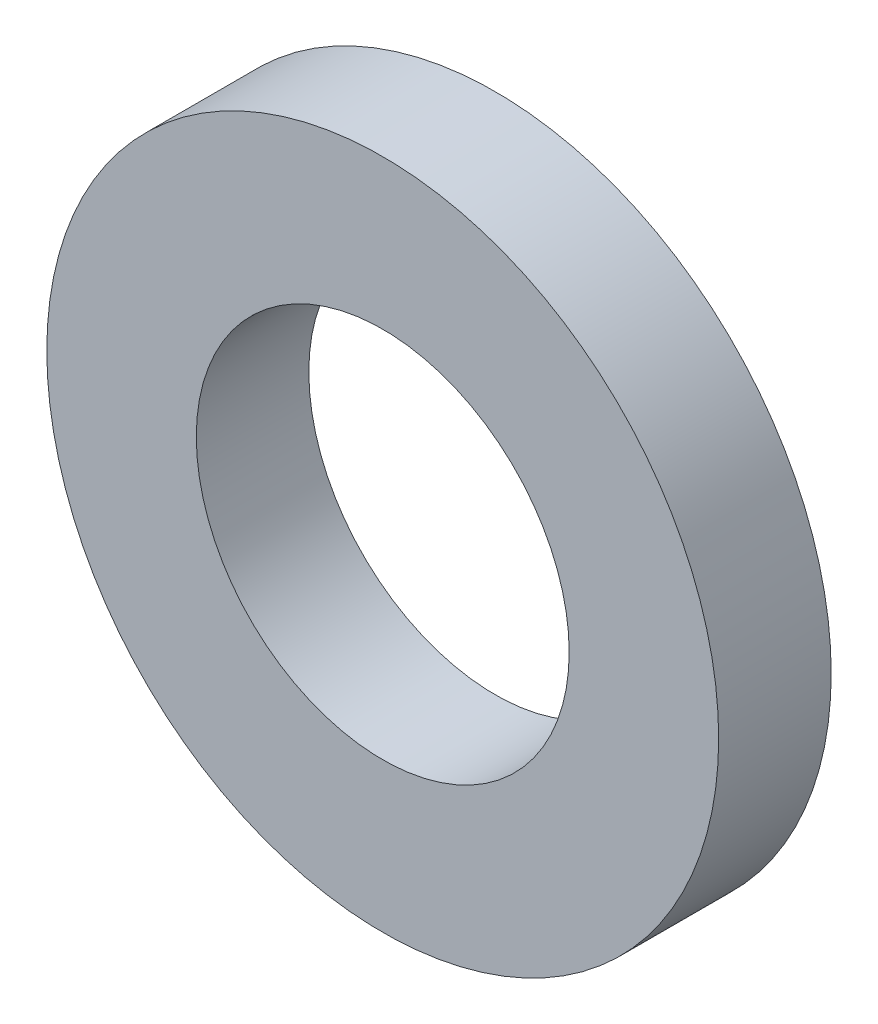
ISO-10303-21;
HEADER;
FILE_DESCRIPTION(('STEP AP214'),'2;1');
FILE_NAME('part.step','',(''),(''),'','','');
FILE_SCHEMA(('AUTOMOTIVE_DESIGN { 1 0 10303 214 1 1 1 1 }'));
ENDSEC;
DATA;
#1=APPLICATION_CONTEXT('core data for automotive mechanical design processes');
#2=APPLICATION_PROTOCOL_DEFINITION('international standard','automotive_design',2000,#1);
#3=PRODUCT_CONTEXT('',#1,'mechanical');
#4=PRODUCT('Part','Part','',(#3));
#5=PRODUCT_RELATED_PRODUCT_CATEGORY('part','',(#4));
#6=PRODUCT_DEFINITION_FORMATION('','',#4);
#7=PRODUCT_DEFINITION_CONTEXT('part definition',#1,'design');
#8=PRODUCT_DEFINITION('design','',#6,#7);
#9=PRODUCT_DEFINITION_SHAPE('','',#8);
#10=(LENGTH_UNIT() NAMED_UNIT(*) SI_UNIT(.MILLI.,.METRE.));
#11=(NAMED_UNIT(*) PLANE_ANGLE_UNIT() SI_UNIT($,.RADIAN.));
#12=(NAMED_UNIT(*) SI_UNIT($,.STERADIAN.) SOLID_ANGLE_UNIT());
#13=UNCERTAINTY_MEASURE_WITH_UNIT(LENGTH_MEASURE(1.E-05),#10,'distance_accuracy_value','');
#14=(GEOMETRIC_REPRESENTATION_CONTEXT(3) GLOBAL_UNCERTAINTY_ASSIGNED_CONTEXT((#13)) GLOBAL_UNIT_ASSIGNED_CONTEXT((#10,
#11,#12)) REPRESENTATION_CONTEXT('',''));
#15=CARTESIAN_POINT('',(0.,0.,0.));
#16=DIRECTION('',(0.,0.,1.));
#17=DIRECTION('',(1.,0.,0.));
#18=AXIS2_PLACEMENT_3D('',#15,#16,#17);
#19=CARTESIAN_POINT('',(0.,0.,0.889));
#20=DIRECTION('',(0.,0.,1.));
#21=DIRECTION('',(1.,0.,0.));
#22=AXIS2_PLACEMENT_3D('',#19,#20,#21);
#23=PLANE('',#22);
#24=CARTESIAN_POINT('',(0.,0.,0.889));
#25=DIRECTION('',(0.,0.,1.));
#26=DIRECTION('',(1.,0.,0.));
#27=AXIS2_PLACEMENT_3D('',#24,#25,#26);
#28=CIRCLE('',#27,2.6543);
#29=CARTESIAN_POINT('',(2.6543,0.,0.889));
#30=VERTEX_POINT('',#29);
#31=EDGE_CURVE('E10',#30,#30,#28,.T.);
#32=ORIENTED_EDGE('',*,*,#31,.T.);
#33=EDGE_LOOP('',(#32));
#34=FACE_BOUND('',#33,.T.);
#35=CARTESIAN_POINT('',(0.,0.,0.889));
#36=DIRECTION('',(0.,0.,1.));
#37=DIRECTION('',(1.,0.,0.));
#38=AXIS2_PLACEMENT_3D('',#35,#36,#37);
#39=CIRCLE('',#38,1.4732);
#40=CARTESIAN_POINT('',(1.4732,0.,0.889));
#41=VERTEX_POINT('',#40);
#42=EDGE_CURVE('E43',#41,#41,#39,.T.);
#43=ORIENTED_EDGE('',*,*,#42,.F.);
#44=EDGE_LOOP('',(#43));
#45=FACE_BOUND('',#44,.T.);
#46=ADVANCED_FACE('F32',(#34,#45),#23,.T.);
#47=CARTESIAN_POINT('',(0.,0.,0.));
#48=DIRECTION('',(0.,0.,1.));
#49=DIRECTION('',(1.,0.,0.));
#50=AXIS2_PLACEMENT_3D('',#47,#48,#49);
#51=PLANE('',#50);
#52=CARTESIAN_POINT('',(0.,0.,0.));
#53=DIRECTION('',(0.,0.,1.));
#54=DIRECTION('',(1.,0.,0.));
#55=AXIS2_PLACEMENT_3D('',#52,#53,#54);
#56=CIRCLE('',#55,2.6543);
#57=CARTESIAN_POINT('',(2.6543,0.,0.));
#58=VERTEX_POINT('',#57);
#59=EDGE_CURVE('E36',#58,#58,#56,.T.);
#60=ORIENTED_EDGE('',*,*,#59,.F.);
#61=EDGE_LOOP('',(#60));
#62=FACE_BOUND('',#61,.T.);
#63=CARTESIAN_POINT('',(0.,0.,0.));
#64=DIRECTION('',(0.,0.,1.));
#65=DIRECTION('',(1.,0.,0.));
#66=AXIS2_PLACEMENT_3D('',#63,#64,#65);
#67=CIRCLE('',#66,1.4732);
#68=CARTESIAN_POINT('',(1.4732,0.,0.));
#69=VERTEX_POINT('',#68);
#70=EDGE_CURVE('E45',#69,#69,#67,.T.);
#71=ORIENTED_EDGE('',*,*,#70,.T.);
#72=EDGE_LOOP('',(#71));
#73=FACE_BOUND('',#72,.T.);
#74=ADVANCED_FACE('F55',(#62,#73),#51,.F.);
#75=CARTESIAN_POINT('',(0.,0.,0.889));
#76=DIRECTION('',(0.,0.,-1.));
#77=DIRECTION('',(-1.,0.,0.));
#78=AXIS2_PLACEMENT_3D('',#75,#76,#77);
#79=CYLINDRICAL_SURFACE('',#78,2.6543);
#80=ORIENTED_EDGE('',*,*,#31,.F.);
#81=EDGE_LOOP('',(#80));
#82=FACE_BOUND('',#81,.T.);
#83=ORIENTED_EDGE('',*,*,#59,.T.);
#84=EDGE_LOOP('',(#83));
#85=FACE_BOUND('',#84,.T.);
#86=ADVANCED_FACE('F34',(#82,#85),#79,.T.);
#87=CARTESIAN_POINT('',(0.,0.,0.889));
#88=DIRECTION('',(0.,0.,-1.));
#89=DIRECTION('',(-1.,0.,0.));
#90=AXIS2_PLACEMENT_3D('',#87,#88,#89);
#91=CYLINDRICAL_SURFACE('',#90,1.4732);
#92=ORIENTED_EDGE('',*,*,#42,.T.);
#93=EDGE_LOOP('',(#92));
#94=FACE_BOUND('',#93,.T.);
#95=ORIENTED_EDGE('',*,*,#70,.F.);
#96=EDGE_LOOP('',(#95));
#97=FACE_BOUND('',#96,.T.);
#98=ADVANCED_FACE('F51',(#94,#97),#91,.F.);
#99=CLOSED_SHELL('',(#46,#74,#86,#98));
#100=MANIFOLD_SOLID_BREP('B2',#99);
#101=ADVANCED_BREP_SHAPE_REPRESENTATION('',(#18,#100),#14);
#102=SHAPE_DEFINITION_REPRESENTATION(#9,#101);
ENDSEC;
END-ISO-10303-21;
